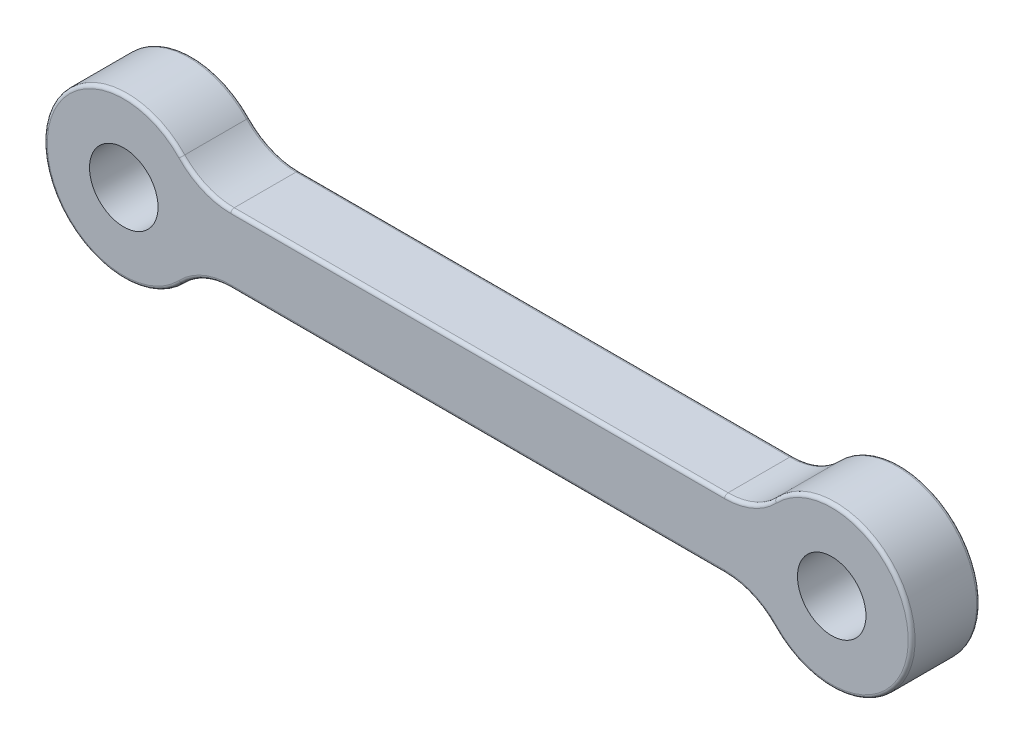
ISO-10303-21;
HEADER;
FILE_DESCRIPTION(('STEP AP214'),'2;1');
FILE_NAME('part.step','',(''),(''),'','','');
FILE_SCHEMA(('AUTOMOTIVE_DESIGN { 1 0 10303 214 1 1 1 1 }'));
ENDSEC;
DATA;
#1=APPLICATION_CONTEXT('core data for automotive mechanical design processes');
#2=APPLICATION_PROTOCOL_DEFINITION('international standard','automotive_design',2000,#1);
#3=PRODUCT_CONTEXT('',#1,'mechanical');
#4=PRODUCT('Part','Part','',(#3));
#5=PRODUCT_RELATED_PRODUCT_CATEGORY('part','',(#4));
#6=PRODUCT_DEFINITION_FORMATION('','',#4);
#7=PRODUCT_DEFINITION_CONTEXT('part definition',#1,'design');
#8=PRODUCT_DEFINITION('design','',#6,#7);
#9=PRODUCT_DEFINITION_SHAPE('','',#8);
#10=(LENGTH_UNIT() NAMED_UNIT(*) SI_UNIT(.MILLI.,.METRE.));
#11=(NAMED_UNIT(*) PLANE_ANGLE_UNIT() SI_UNIT($,.RADIAN.));
#12=(NAMED_UNIT(*) SI_UNIT($,.STERADIAN.) SOLID_ANGLE_UNIT());
#13=UNCERTAINTY_MEASURE_WITH_UNIT(LENGTH_MEASURE(1.E-05),#10,'distance_accuracy_value','');
#14=(GEOMETRIC_REPRESENTATION_CONTEXT(3) GLOBAL_UNCERTAINTY_ASSIGNED_CONTEXT((#13)) GLOBAL_UNIT_ASSIGNED_CONTEXT((#10,
#11,#12)) REPRESENTATION_CONTEXT('',''));
#15=CARTESIAN_POINT('',(0.,0.,0.));
#16=DIRECTION('',(0.,0.,1.));
#17=DIRECTION('',(1.,0.,0.));
#18=AXIS2_PLACEMENT_3D('',#15,#16,#17);
#19=CARTESIAN_POINT('',(13.5714024219947,4.5,1.35));
#20=DIRECTION('',(0.,0.,1.));
#21=DIRECTION('',(1.,0.,0.));
#22=AXIS2_PLACEMENT_3D('',#19,#20,#21);
#23=TOROIDAL_SURFACE('',#22,3.15,0.15);
#24=CARTESIAN_POINT('',(15.8444500594476,2.31923076923077,1.35));
#25=DIRECTION('',(-0.6923076923077,-0.721602424588213,0.));
#26=DIRECTION('',(0.721602424588213,-0.6923076923077,0.));
#27=AXIS2_PLACEMENT_3D('',#24,#25,#26);
#28=CIRCLE('',#27,0.15);
#29=CARTESIAN_POINT('',(15.8444500594476,2.31923076923077,1.5));
#30=VERTEX_POINT('',#29);
#31=CARTESIAN_POINT('',(15.7362096957594,2.42307692307692,1.35));
#32=VERTEX_POINT('',#31);
#33=EDGE_CURVE('E461',#30,#32,#28,.T.);
#34=ORIENTED_EDGE('',*,*,#33,.T.);
#35=CARTESIAN_POINT('',(13.5714024219947,4.5,1.35));
#36=DIRECTION('',(0.,0.,1.));
#37=DIRECTION('',(1.,0.,0.));
#38=AXIS2_PLACEMENT_3D('',#35,#36,#37);
#39=CIRCLE('',#38,3.);
#40=CARTESIAN_POINT('',(13.5714024219947,1.5,1.35));
#41=VERTEX_POINT('',#40);
#42=EDGE_CURVE('E246',#41,#32,#39,.T.);
#43=ORIENTED_EDGE('',*,*,#42,.F.);
#44=CARTESIAN_POINT('',(13.5714024219947,1.35,1.35));
#45=DIRECTION('',(1.,0.,0.));
#46=DIRECTION('',(0.,0.,-1.));
#47=AXIS2_PLACEMENT_3D('',#44,#45,#46);
#48=CIRCLE('',#47,0.15);
#49=CARTESIAN_POINT('',(13.5714024219947,1.35,1.5));
#50=VERTEX_POINT('',#49);
#51=EDGE_CURVE('E11',#41,#50,#48,.T.);
#52=ORIENTED_EDGE('',*,*,#51,.T.);
#53=CARTESIAN_POINT('',(13.5714024219947,4.5,1.5));
#54=DIRECTION('',(0.,0.,-1.));
#55=DIRECTION('',(1.,0.,0.));
#56=AXIS2_PLACEMENT_3D('',#53,#54,#55);
#57=CIRCLE('',#56,3.15);
#58=EDGE_CURVE('E296',#30,#50,#57,.T.);
#59=ORIENTED_EDGE('',*,*,#58,.F.);
#60=EDGE_LOOP('',(#34,#43,#52,#59));
#61=FACE_BOUND('',#60,.T.);
#62=ADVANCED_FACE('F17',(#61),#23,.T.);
#63=CARTESIAN_POINT('',(0.,1.35,1.35));
#64=DIRECTION('',(1.,0.,0.));
#65=DIRECTION('',(0.,0.,-1.));
#66=AXIS2_PLACEMENT_3D('',#63,#64,#65);
#67=CYLINDRICAL_SURFACE('',#66,0.15);
#68=CARTESIAN_POINT('',(-8.0477660583584,1.35,1.35));
#69=DIRECTION('',(1.,0.,0.));
#70=DIRECTION('',(0.,0.,-1.));
#71=AXIS2_PLACEMENT_3D('',#68,#69,#70);
#72=CIRCLE('',#71,0.15);
#73=CARTESIAN_POINT('',(-8.0477660583584,1.5,1.35));
#74=VERTEX_POINT('',#73);
#75=CARTESIAN_POINT('',(-8.0477660583584,1.35,1.5));
#76=VERTEX_POINT('',#75);
#77=EDGE_CURVE('E25',#74,#76,#72,.T.);
#78=ORIENTED_EDGE('',*,*,#77,.T.);
#79=DIRECTION('',(-1.,0.,0.));
#80=VECTOR('',#79,1.);
#81=CARTESIAN_POINT('',(-8.0477660583584,1.35,1.5));
#82=LINE('',#81,#80);
#83=EDGE_CURVE('E288',#50,#76,#82,.T.);
#84=ORIENTED_EDGE('',*,*,#83,.F.);
#85=ORIENTED_EDGE('',*,*,#51,.F.);
#86=DIRECTION('',(1.,0.,0.));
#87=VECTOR('',#86,1.);
#88=CARTESIAN_POINT('',(13.5714024219947,1.5,1.35));
#89=LINE('',#88,#87);
#90=EDGE_CURVE('E263',#74,#41,#89,.T.);
#91=ORIENTED_EDGE('',*,*,#90,.F.);
#92=EDGE_LOOP('',(#78,#84,#85,#91));
#93=FACE_BOUND('',#92,.T.);
#94=ADVANCED_FACE('F376',(#93),#67,.T.);
#95=CARTESIAN_POINT('',(-8.0477660583584,4.5,1.35));
#96=DIRECTION('',(0.,0.,1.));
#97=DIRECTION('',(1.,0.,0.));
#98=AXIS2_PLACEMENT_3D('',#95,#96,#97);
#99=TOROIDAL_SURFACE('',#98,3.15,0.15);
#100=CARTESIAN_POINT('',(-10.3208136958113,2.31923076923077,1.35));
#101=DIRECTION('',(0.692307692307693,-0.72160242458822,0.));
#102=DIRECTION('',(0.72160242458822,0.692307692307693,0.));
#103=AXIS2_PLACEMENT_3D('',#100,#101,#102);
#104=CIRCLE('',#103,0.15);
#105=CARTESIAN_POINT('',(-10.2125733321231,2.42307692307692,1.35));
#106=VERTEX_POINT('',#105);
#107=CARTESIAN_POINT('',(-10.3208136958113,2.31923076923077,1.5));
#108=VERTEX_POINT('',#107);
#109=EDGE_CURVE('E224',#106,#108,#104,.T.);
#110=ORIENTED_EDGE('',*,*,#109,.T.);
#111=CARTESIAN_POINT('',(-8.0477660583584,4.5,1.5));
#112=DIRECTION('',(0.,0.,-1.));
#113=DIRECTION('',(1.,0.,0.));
#114=AXIS2_PLACEMENT_3D('',#111,#112,#113);
#115=CIRCLE('',#114,3.15);
#116=EDGE_CURVE('E283',#76,#108,#115,.T.);
#117=ORIENTED_EDGE('',*,*,#116,.F.);
#118=ORIENTED_EDGE('',*,*,#77,.F.);
#119=CARTESIAN_POINT('',(-8.0477660583584,4.5,1.35));
#120=DIRECTION('',(0.,0.,1.));
#121=DIRECTION('',(1.,0.,0.));
#122=AXIS2_PLACEMENT_3D('',#119,#120,#121);
#123=CIRCLE('',#122,3.);
#124=EDGE_CURVE('E247',#106,#74,#123,.T.);
#125=ORIENTED_EDGE('',*,*,#124,.F.);
#126=EDGE_LOOP('',(#110,#117,#118,#125));
#127=FACE_BOUND('',#126,.T.);
#128=ADVANCED_FACE('F366',(#127),#99,.T.);
#129=CARTESIAN_POINT('',(13.5714024219947,-4.5,1.35));
#130=DIRECTION('',(0.,0.,1.));
#131=DIRECTION('',(1.,0.,0.));
#132=AXIS2_PLACEMENT_3D('',#129,#130,#131);
#133=TOROIDAL_SURFACE('',#132,3.15,0.15);
#134=CARTESIAN_POINT('',(13.5714024219947,-1.35,1.35));
#135=DIRECTION('',(1.,0.,0.));
#136=DIRECTION('',(0.,0.,-1.));
#137=AXIS2_PLACEMENT_3D('',#134,#135,#136);
#138=CIRCLE('',#137,0.15);
#139=CARTESIAN_POINT('',(13.5714024219947,-1.35,1.5));
#140=VERTEX_POINT('',#139);
#141=CARTESIAN_POINT('',(13.5714024219947,-1.5,1.35));
#142=VERTEX_POINT('',#141);
#143=EDGE_CURVE('E257',#140,#142,#138,.T.);
#144=ORIENTED_EDGE('',*,*,#143,.T.);
#145=CARTESIAN_POINT('',(13.5714024219947,-4.5,1.35));
#146=DIRECTION('',(0.,0.,1.));
#147=DIRECTION('',(1.,0.,0.));
#148=AXIS2_PLACEMENT_3D('',#145,#146,#147);
#149=CIRCLE('',#148,3.);
#150=CARTESIAN_POINT('',(15.7362096957594,-2.42307692307692,1.35));
#151=VERTEX_POINT('',#150);
#152=EDGE_CURVE('E315',#151,#142,#149,.T.);
#153=ORIENTED_EDGE('',*,*,#152,.F.);
#154=CARTESIAN_POINT('',(15.8444500594476,-2.31923076923077,1.35));
#155=DIRECTION('',(0.6923076923077,-0.721602424588213,0.));
#156=DIRECTION('',(0.721602424588213,0.6923076923077,0.));
#157=AXIS2_PLACEMENT_3D('',#154,#155,#156);
#158=CIRCLE('',#157,0.15);
#159=CARTESIAN_POINT('',(15.8444500594476,-2.31923076923077,1.5));
#160=VERTEX_POINT('',#159);
#161=EDGE_CURVE('E440',#160,#151,#158,.T.);
#162=ORIENTED_EDGE('',*,*,#161,.F.);
#163=CARTESIAN_POINT('',(13.5714024219947,-4.5,1.5));
#164=DIRECTION('',(0.,0.,-1.));
#165=DIRECTION('',(1.,0.,0.));
#166=AXIS2_PLACEMENT_3D('',#163,#164,#165);
#167=CIRCLE('',#166,3.15);
#168=EDGE_CURVE('E311',#140,#160,#167,.T.);
#169=ORIENTED_EDGE('',*,*,#168,.F.);
#170=EDGE_LOOP('',(#144,#153,#162,#169));
#171=FACE_BOUND('',#170,.T.);
#172=ADVANCED_FACE('F483',(#171),#133,.T.);
#173=CARTESIAN_POINT('',(-12.7381818181818,0.,1.35));
#174=DIRECTION('',(0.,0.,1.));
#175=DIRECTION('',(-1.,0.,0.));
#176=AXIS2_PLACEMENT_3D('',#173,#174,#175);
#177=TOROIDAL_SURFACE('',#176,3.35,0.15);
#178=CARTESIAN_POINT('',(-10.3208136958113,-2.31923076923077,1.35));
#179=DIRECTION('',(-0.692307692307693,-0.72160242458822,0.));
#180=DIRECTION('',(0.72160242458822,-0.692307692307693,0.));
#181=AXIS2_PLACEMENT_3D('',#178,#179,#180);
#182=CIRCLE('',#181,0.15);
#183=CARTESIAN_POINT('',(-10.2125733321231,-2.42307692307692,1.35));
#184=VERTEX_POINT('',#183);
#185=CARTESIAN_POINT('',(-10.3208136958113,-2.31923076923077,1.5));
#186=VERTEX_POINT('',#185);
#187=EDGE_CURVE('E184',#184,#186,#182,.T.);
#188=ORIENTED_EDGE('',*,*,#187,.T.);
#189=CARTESIAN_POINT('',(-12.7381818181818,0.,1.5));
#190=DIRECTION('',(0.,0.,1.));
#191=DIRECTION('',(1.,0.,0.));
#192=AXIS2_PLACEMENT_3D('',#189,#190,#191);
#193=CIRCLE('',#192,3.35);
#194=EDGE_CURVE('E287',#108,#186,#193,.T.);
#195=ORIENTED_EDGE('',*,*,#194,.F.);
#196=ORIENTED_EDGE('',*,*,#109,.F.);
#197=CARTESIAN_POINT('',(-12.7381818181818,0.,1.35));
#198=DIRECTION('',(0.,0.,-1.));
#199=DIRECTION('',(1.,0.,0.));
#200=AXIS2_PLACEMENT_3D('',#197,#198,#199);
#201=CIRCLE('',#200,3.5);
#202=EDGE_CURVE('E217',#184,#106,#201,.T.);
#203=ORIENTED_EDGE('',*,*,#202,.F.);
#204=EDGE_LOOP('',(#188,#195,#196,#203));
#205=FACE_BOUND('',#204,.T.);
#206=ADVANCED_FACE('F223',(#205),#177,.T.);
#207=CARTESIAN_POINT('',(0.,-1.35,1.35));
#208=DIRECTION('',(-1.,0.,0.));
#209=DIRECTION('',(0.,0.,1.));
#210=AXIS2_PLACEMENT_3D('',#207,#208,#209);
#211=CYLINDRICAL_SURFACE('',#210,0.15);
#212=CARTESIAN_POINT('',(-8.0477660583584,-1.35,1.35));
#213=DIRECTION('',(1.,0.,0.));
#214=DIRECTION('',(0.,0.,-1.));
#215=AXIS2_PLACEMENT_3D('',#212,#213,#214);
#216=CIRCLE('',#215,0.15);
#217=CARTESIAN_POINT('',(-8.0477660583584,-1.35,1.5));
#218=VERTEX_POINT('',#217);
#219=CARTESIAN_POINT('',(-8.0477660583584,-1.5,1.35));
#220=VERTEX_POINT('',#219);
#221=EDGE_CURVE('E196',#218,#220,#216,.T.);
#222=ORIENTED_EDGE('',*,*,#221,.T.);
#223=DIRECTION('',(-1.,0.,0.));
#224=VECTOR('',#223,1.);
#225=CARTESIAN_POINT('',(0.,-1.5,1.35));
#226=LINE('',#225,#224);
#227=EDGE_CURVE('E273',#142,#220,#226,.T.);
#228=ORIENTED_EDGE('',*,*,#227,.F.);
#229=ORIENTED_EDGE('',*,*,#143,.F.);
#230=DIRECTION('',(1.,0.,0.));
#231=VECTOR('',#230,1.);
#232=CARTESIAN_POINT('',(0.,-1.35,1.5));
#233=LINE('',#232,#231);
#234=EDGE_CURVE('E307',#218,#140,#233,.T.);
#235=ORIENTED_EDGE('',*,*,#234,.F.);
#236=EDGE_LOOP('',(#222,#228,#229,#235));
#237=FACE_BOUND('',#236,.T.);
#238=ADVANCED_FACE('F517',(#237),#211,.T.);
#239=CARTESIAN_POINT('',(-8.0477660583584,-4.5,1.35));
#240=DIRECTION('',(0.,0.,1.));
#241=DIRECTION('',(1.,0.,0.));
#242=AXIS2_PLACEMENT_3D('',#239,#240,#241);
#243=TOROIDAL_SURFACE('',#242,3.15,0.15);
#244=ORIENTED_EDGE('',*,*,#187,.F.);
#245=CARTESIAN_POINT('',(-8.0477660583584,-4.5,1.35));
#246=DIRECTION('',(0.,0.,1.));
#247=DIRECTION('',(1.,0.,0.));
#248=AXIS2_PLACEMENT_3D('',#245,#246,#247);
#249=CIRCLE('',#248,3.);
#250=EDGE_CURVE('E187',#220,#184,#249,.T.);
#251=ORIENTED_EDGE('',*,*,#250,.F.);
#252=ORIENTED_EDGE('',*,*,#221,.F.);
#253=CARTESIAN_POINT('',(-8.0477660583584,-4.5,1.5));
#254=DIRECTION('',(0.,0.,-1.));
#255=DIRECTION('',(1.,0.,0.));
#256=AXIS2_PLACEMENT_3D('',#253,#254,#255);
#257=CIRCLE('',#256,3.15);
#258=EDGE_CURVE('E190',#186,#218,#257,.T.);
#259=ORIENTED_EDGE('',*,*,#258,.F.);
#260=EDGE_LOOP('',(#244,#251,#252,#259));
#261=FACE_BOUND('',#260,.T.);
#262=ADVANCED_FACE('F186',(#261),#243,.T.);
#263=CARTESIAN_POINT('',(13.5714024219947,-4.5,-1.35));
#264=DIRECTION('',(0.,0.,1.));
#265=DIRECTION('',(1.,0.,0.));
#266=AXIS2_PLACEMENT_3D('',#263,#264,#265);
#267=TOROIDAL_SURFACE('',#266,3.15,0.15);
#268=CARTESIAN_POINT('',(15.8444500594476,-2.31923076923077,-1.35));
#269=DIRECTION('',(-0.6923076923077,0.721602424588213,0.));
#270=DIRECTION('',(-0.721602424588213,-0.6923076923077,0.));
#271=AXIS2_PLACEMENT_3D('',#268,#269,#270);
#272=CIRCLE('',#271,0.15);
#273=CARTESIAN_POINT('',(15.8444500594476,-2.31923076923077,-1.5));
#274=VERTEX_POINT('',#273);
#275=CARTESIAN_POINT('',(15.7362096957594,-2.42307692307692,-1.35));
#276=VERTEX_POINT('',#275);
#277=EDGE_CURVE('E403',#274,#276,#272,.T.);
#278=ORIENTED_EDGE('',*,*,#277,.T.);
#279=CARTESIAN_POINT('',(13.5714024219947,-4.5,-1.35));
#280=DIRECTION('',(0.,0.,-1.));
#281=DIRECTION('',(1.,0.,0.));
#282=AXIS2_PLACEMENT_3D('',#279,#280,#281);
#283=CIRCLE('',#282,3.);
#284=CARTESIAN_POINT('',(13.5714024219947,-1.5,-1.35));
#285=VERTEX_POINT('',#284);
#286=EDGE_CURVE('E210',#285,#276,#283,.T.);
#287=ORIENTED_EDGE('',*,*,#286,.F.);
#288=CARTESIAN_POINT('',(13.5714024219947,-1.35,-1.35));
#289=DIRECTION('',(1.,0.,0.));
#290=DIRECTION('',(0.,0.,-1.));
#291=AXIS2_PLACEMENT_3D('',#288,#289,#290);
#292=CIRCLE('',#291,0.15);
#293=CARTESIAN_POINT('',(13.5714024219947,-1.35,-1.5));
#294=VERTEX_POINT('',#293);
#295=EDGE_CURVE('E197',#285,#294,#292,.T.);
#296=ORIENTED_EDGE('',*,*,#295,.T.);
#297=CARTESIAN_POINT('',(13.5714024219947,-4.5,-1.5));
#298=DIRECTION('',(0.,0.,1.));
#299=DIRECTION('',(1.,0.,0.));
#300=AXIS2_PLACEMENT_3D('',#297,#298,#299);
#301=CIRCLE('',#300,3.15);
#302=EDGE_CURVE('E314',#274,#294,#301,.T.);
#303=ORIENTED_EDGE('',*,*,#302,.F.);
#304=EDGE_LOOP('',(#278,#287,#296,#303));
#305=FACE_BOUND('',#304,.T.);
#306=ADVANCED_FACE('F490',(#305),#267,.T.);
#307=CARTESIAN_POINT('',(0.,-1.35,-1.35));
#308=DIRECTION('',(1.,0.,0.));
#309=DIRECTION('',(0.,0.,-1.));
#310=AXIS2_PLACEMENT_3D('',#307,#308,#309);
#311=CYLINDRICAL_SURFACE('',#310,0.15);
#312=CARTESIAN_POINT('',(-8.0477660583584,-1.35,-1.35));
#313=DIRECTION('',(1.,0.,0.));
#314=DIRECTION('',(0.,0.,-1.));
#315=AXIS2_PLACEMENT_3D('',#312,#313,#314);
#316=CIRCLE('',#315,0.15);
#317=CARTESIAN_POINT('',(-8.0477660583584,-1.5,-1.35));
#318=VERTEX_POINT('',#317);
#319=CARTESIAN_POINT('',(-8.0477660583584,-1.35,-1.5));
#320=VERTEX_POINT('',#319);
#321=EDGE_CURVE('E356',#318,#320,#316,.T.);
#322=ORIENTED_EDGE('',*,*,#321,.T.);
#323=DIRECTION('',(-1.,0.,0.));
#324=VECTOR('',#323,1.);
#325=CARTESIAN_POINT('',(-8.0477660583584,-1.35,-1.5));
#326=LINE('',#325,#324);
#327=EDGE_CURVE('E324',#294,#320,#326,.T.);
#328=ORIENTED_EDGE('',*,*,#327,.F.);
#329=ORIENTED_EDGE('',*,*,#295,.F.);
#330=DIRECTION('',(1.,0.,0.));
#331=VECTOR('',#330,1.);
#332=CARTESIAN_POINT('',(13.5714024219947,-1.5,-1.35));
#333=LINE('',#332,#331);
#334=EDGE_CURVE('E278',#318,#285,#333,.T.);
#335=ORIENTED_EDGE('',*,*,#334,.F.);
#336=EDGE_LOOP('',(#322,#328,#329,#335));
#337=FACE_BOUND('',#336,.T.);
#338=ADVANCED_FACE('F496',(#337),#311,.T.);
#339=CARTESIAN_POINT('',(-8.0477660583584,-4.5,-1.35));
#340=DIRECTION('',(0.,0.,1.));
#341=DIRECTION('',(1.,0.,0.));
#342=AXIS2_PLACEMENT_3D('',#339,#340,#341);
#343=TOROIDAL_SURFACE('',#342,3.15,0.15);
#344=CARTESIAN_POINT('',(-10.3208136958113,-2.31923076923077,-1.35));
#345=DIRECTION('',(0.692307692307693,0.72160242458822,0.));
#346=DIRECTION('',(-0.72160242458822,0.692307692307693,0.));
#347=AXIS2_PLACEMENT_3D('',#344,#345,#346);
#348=CIRCLE('',#347,0.15);
#349=CARTESIAN_POINT('',(-10.2125733321231,-2.42307692307692,-1.35));
#350=VERTEX_POINT('',#349);
#351=CARTESIAN_POINT('',(-10.3208136958113,-2.31923076923077,-1.5));
#352=VERTEX_POINT('',#351);
#353=EDGE_CURVE('E347',#350,#352,#348,.T.);
#354=ORIENTED_EDGE('',*,*,#353,.T.);
#355=CARTESIAN_POINT('',(-8.0477660583584,-4.5,-1.5));
#356=DIRECTION('',(0.,0.,1.));
#357=DIRECTION('',(1.,0.,0.));
#358=AXIS2_PLACEMENT_3D('',#355,#356,#357);
#359=CIRCLE('',#358,3.15);
#360=EDGE_CURVE('E328',#320,#352,#359,.T.);
#361=ORIENTED_EDGE('',*,*,#360,.F.);
#362=ORIENTED_EDGE('',*,*,#321,.F.);
#363=CARTESIAN_POINT('',(-8.0477660583584,-4.5,-1.35));
#364=DIRECTION('',(0.,0.,-1.));
#365=DIRECTION('',(1.,0.,0.));
#366=AXIS2_PLACEMENT_3D('',#363,#364,#365);
#367=CIRCLE('',#366,3.);
#368=EDGE_CURVE('E211',#350,#318,#367,.T.);
#369=ORIENTED_EDGE('',*,*,#368,.F.);
#370=EDGE_LOOP('',(#354,#361,#362,#369));
#371=FACE_BOUND('',#370,.T.);
#372=ADVANCED_FACE('F390',(#371),#343,.T.);
#373=CARTESIAN_POINT('',(13.5714024219947,4.5,-1.35));
#374=DIRECTION('',(0.,0.,1.));
#375=DIRECTION('',(1.,0.,0.));
#376=AXIS2_PLACEMENT_3D('',#373,#374,#375);
#377=TOROIDAL_SURFACE('',#376,3.15,0.15);
#378=CARTESIAN_POINT('',(13.5714024219947,1.35,-1.35));
#379=DIRECTION('',(1.,0.,0.));
#380=DIRECTION('',(0.,0.,-1.));
#381=AXIS2_PLACEMENT_3D('',#378,#379,#380);
#382=CIRCLE('',#381,0.15);
#383=CARTESIAN_POINT('',(13.5714024219947,1.35,-1.5));
#384=VERTEX_POINT('',#383);
#385=CARTESIAN_POINT('',(13.5714024219947,1.5,-1.35));
#386=VERTEX_POINT('',#385);
#387=EDGE_CURVE('E37',#384,#386,#382,.T.);
#388=ORIENTED_EDGE('',*,*,#387,.T.);
#389=CARTESIAN_POINT('',(13.5714024219947,4.5,-1.35));
#390=DIRECTION('',(0.,0.,-1.));
#391=DIRECTION('',(1.,0.,0.));
#392=AXIS2_PLACEMENT_3D('',#389,#390,#391);
#393=CIRCLE('',#392,3.);
#394=CARTESIAN_POINT('',(15.7362096957594,2.42307692307692,-1.35));
#395=VERTEX_POINT('',#394);
#396=EDGE_CURVE('E243',#395,#386,#393,.T.);
#397=ORIENTED_EDGE('',*,*,#396,.F.);
#398=CARTESIAN_POINT('',(15.8444500594476,2.31923076923077,-1.35));
#399=DIRECTION('',(0.6923076923077,0.721602424588213,0.));
#400=DIRECTION('',(-0.721602424588213,0.6923076923077,0.));
#401=AXIS2_PLACEMENT_3D('',#398,#399,#400);
#402=CIRCLE('',#401,0.15);
#403=CARTESIAN_POINT('',(15.8444500594476,2.31923076923077,-1.5));
#404=VERTEX_POINT('',#403);
#405=EDGE_CURVE('E404',#404,#395,#402,.T.);
#406=ORIENTED_EDGE('',*,*,#405,.F.);
#407=CARTESIAN_POINT('',(13.5714024219947,4.5,-1.5));
#408=DIRECTION('',(0.,0.,1.));
#409=DIRECTION('',(1.,0.,0.));
#410=AXIS2_PLACEMENT_3D('',#407,#408,#409);
#411=CIRCLE('',#410,3.15);
#412=EDGE_CURVE('E300',#384,#404,#411,.T.);
#413=ORIENTED_EDGE('',*,*,#412,.F.);
#414=EDGE_LOOP('',(#388,#397,#406,#413));
#415=FACE_BOUND('',#414,.T.);
#416=ADVANCED_FACE('F564',(#415),#377,.T.);
#417=CARTESIAN_POINT('',(-12.7381818181818,0.,-1.35));
#418=DIRECTION('',(0.,0.,1.));
#419=DIRECTION('',(-1.,0.,0.));
#420=AXIS2_PLACEMENT_3D('',#417,#418,#419);
#421=TOROIDAL_SURFACE('',#420,3.35,0.15);
#422=CARTESIAN_POINT('',(-10.3208136958113,2.31923076923077,-1.35));
#423=DIRECTION('',(-0.692307692307693,0.72160242458822,0.));
#424=DIRECTION('',(-0.72160242458822,-0.692307692307693,0.));
#425=AXIS2_PLACEMENT_3D('',#422,#423,#424);
#426=CIRCLE('',#425,0.15);
#427=CARTESIAN_POINT('',(-10.2125733321231,2.42307692307692,-1.35));
#428=VERTEX_POINT('',#427);
#429=CARTESIAN_POINT('',(-10.3208136958113,2.31923076923077,-1.5));
#430=VERTEX_POINT('',#429);
#431=EDGE_CURVE('E319',#428,#430,#426,.T.);
#432=ORIENTED_EDGE('',*,*,#431,.T.);
#433=CARTESIAN_POINT('',(-12.7381818181818,0.,-1.5));
#434=DIRECTION('',(0.,0.,-1.));
#435=DIRECTION('',(1.,0.,0.));
#436=AXIS2_PLACEMENT_3D('',#433,#434,#435);
#437=CIRCLE('',#436,3.35);
#438=EDGE_CURVE('E332',#352,#430,#437,.T.);
#439=ORIENTED_EDGE('',*,*,#438,.F.);
#440=ORIENTED_EDGE('',*,*,#353,.F.);
#441=CARTESIAN_POINT('',(-12.7381818181818,0.,-1.35));
#442=DIRECTION('',(0.,0.,1.));
#443=DIRECTION('',(1.,0.,0.));
#444=AXIS2_PLACEMENT_3D('',#441,#442,#443);
#445=CIRCLE('',#444,3.5);
#446=EDGE_CURVE('E219',#428,#350,#445,.T.);
#447=ORIENTED_EDGE('',*,*,#446,.F.);
#448=EDGE_LOOP('',(#432,#439,#440,#447));
#449=FACE_BOUND('',#448,.T.);
#450=ADVANCED_FACE('F383',(#449),#421,.T.);
#451=CARTESIAN_POINT('',(0.,1.35,-1.35));
#452=DIRECTION('',(-1.,0.,0.));
#453=DIRECTION('',(0.,0.,1.));
#454=AXIS2_PLACEMENT_3D('',#451,#452,#453);
#455=CYLINDRICAL_SURFACE('',#454,0.15);
#456=CARTESIAN_POINT('',(-8.0477660583584,1.35,-1.35));
#457=DIRECTION('',(1.,0.,0.));
#458=DIRECTION('',(0.,0.,-1.));
#459=AXIS2_PLACEMENT_3D('',#456,#457,#458);
#460=CIRCLE('',#459,0.15);
#461=CARTESIAN_POINT('',(-8.0477660583584,1.35,-1.5));
#462=VERTEX_POINT('',#461);
#463=CARTESIAN_POINT('',(-8.0477660583584,1.5,-1.35));
#464=VERTEX_POINT('',#463);
#465=EDGE_CURVE('E47',#462,#464,#460,.T.);
#466=ORIENTED_EDGE('',*,*,#465,.T.);
#467=DIRECTION('',(-1.,0.,0.));
#468=VECTOR('',#467,1.);
#469=CARTESIAN_POINT('',(0.,1.5,-1.35));
#470=LINE('',#469,#468);
#471=EDGE_CURVE('E252',#386,#464,#470,.T.);
#472=ORIENTED_EDGE('',*,*,#471,.F.);
#473=ORIENTED_EDGE('',*,*,#387,.F.);
#474=DIRECTION('',(1.,0.,0.));
#475=VECTOR('',#474,1.);
#476=CARTESIAN_POINT('',(0.,1.35,-1.5));
#477=LINE('',#476,#475);
#478=EDGE_CURVE('E304',#462,#384,#477,.T.);
#479=ORIENTED_EDGE('',*,*,#478,.F.);
#480=EDGE_LOOP('',(#466,#472,#473,#479));
#481=FACE_BOUND('',#480,.T.);
#482=ADVANCED_FACE('F499',(#481),#455,.T.);
#483=CARTESIAN_POINT('',(-8.0477660583584,4.5,-1.35));
#484=DIRECTION('',(0.,0.,1.));
#485=DIRECTION('',(1.,0.,0.));
#486=AXIS2_PLACEMENT_3D('',#483,#484,#485);
#487=TOROIDAL_SURFACE('',#486,3.15,0.15);
#488=ORIENTED_EDGE('',*,*,#431,.F.);
#489=CARTESIAN_POINT('',(-8.0477660583584,4.5,-1.35));
#490=DIRECTION('',(0.,0.,-1.));
#491=DIRECTION('',(1.,0.,0.));
#492=AXIS2_PLACEMENT_3D('',#489,#490,#491);
#493=CIRCLE('',#492,3.);
#494=EDGE_CURVE('E303',#464,#428,#493,.T.);
#495=ORIENTED_EDGE('',*,*,#494,.F.);
#496=ORIENTED_EDGE('',*,*,#465,.F.);
#497=CARTESIAN_POINT('',(-8.0477660583584,4.5,-1.5));
#498=DIRECTION('',(0.,0.,1.));
#499=DIRECTION('',(1.,0.,0.));
#500=AXIS2_PLACEMENT_3D('',#497,#498,#499);
#501=CIRCLE('',#500,3.15);
#502=EDGE_CURVE('E323',#430,#462,#501,.T.);
#503=ORIENTED_EDGE('',*,*,#502,.F.);
#504=EDGE_LOOP('',(#488,#495,#496,#503));
#505=FACE_BOUND('',#504,.T.);
#506=ADVANCED_FACE('F497',(#505),#487,.T.);
#507=CARTESIAN_POINT('',(13.5714024219947,-4.5,1.5));
#508=DIRECTION('',(0.,0.,-1.));
#509=DIRECTION('',(-1.,0.,0.));
#510=AXIS2_PLACEMENT_3D('',#507,#508,#509);
#511=CYLINDRICAL_SURFACE('',#510,3.);
#512=DIRECTION('',(0.,0.,1.));
#513=VECTOR('',#512,1.);
#514=CARTESIAN_POINT('',(13.5714024219947,-1.5,1.5));
#515=LINE('',#514,#513);
#516=EDGE_CURVE('E267',#285,#142,#515,.T.);
#517=ORIENTED_EDGE('',*,*,#516,.F.);
#518=ORIENTED_EDGE('',*,*,#286,.T.);
#519=DIRECTION('',(0.,0.,-1.));
#520=VECTOR('',#519,1.);
#521=CARTESIAN_POINT('',(15.7362096957594,-2.42307692307692,1.5));
#522=LINE('',#521,#520);
#523=EDGE_CURVE('E282',#151,#276,#522,.T.);
#524=ORIENTED_EDGE('',*,*,#523,.F.);
#525=ORIENTED_EDGE('',*,*,#152,.T.);
#526=EDGE_LOOP('',(#517,#518,#524,#525));
#527=FACE_BOUND('',#526,.T.);
#528=ADVANCED_FACE('F487',(#527),#511,.F.);
#529=CARTESIAN_POINT('',(-8.0477660583584,-4.5,1.5));
#530=DIRECTION('',(0.,0.,-1.));
#531=DIRECTION('',(-1.,0.,0.));
#532=AXIS2_PLACEMENT_3D('',#529,#530,#531);
#533=CYLINDRICAL_SURFACE('',#532,3.);
#534=DIRECTION('',(0.,0.,1.));
#535=VECTOR('',#534,1.);
#536=CARTESIAN_POINT('',(-10.2125733321231,-2.42307692307692,1.5));
#537=LINE('',#536,#535);
#538=EDGE_CURVE('E204',#350,#184,#537,.T.);
#539=ORIENTED_EDGE('',*,*,#538,.F.);
#540=ORIENTED_EDGE('',*,*,#368,.T.);
#541=DIRECTION('',(0.,0.,-1.));
#542=VECTOR('',#541,1.);
#543=CARTESIAN_POINT('',(-8.0477660583584,-1.5,1.5));
#544=LINE('',#543,#542);
#545=EDGE_CURVE('E207',#220,#318,#544,.T.);
#546=ORIENTED_EDGE('',*,*,#545,.F.);
#547=ORIENTED_EDGE('',*,*,#250,.T.);
#548=EDGE_LOOP('',(#539,#540,#546,#547));
#549=FACE_BOUND('',#548,.T.);
#550=ADVANCED_FACE('F202',(#549),#533,.F.);
#551=CARTESIAN_POINT('',(13.5714024219947,4.5,1.5));
#552=DIRECTION('',(0.,0.,-1.));
#553=DIRECTION('',(-1.,0.,0.));
#554=AXIS2_PLACEMENT_3D('',#551,#552,#553);
#555=CYLINDRICAL_SURFACE('',#554,3.);
#556=DIRECTION('',(0.,0.,1.));
#557=VECTOR('',#556,1.);
#558=CARTESIAN_POINT('',(15.7362096957594,2.42307692307692,1.5));
#559=LINE('',#558,#557);
#560=EDGE_CURVE('E292',#395,#32,#559,.T.);
#561=ORIENTED_EDGE('',*,*,#560,.F.);
#562=ORIENTED_EDGE('',*,*,#396,.T.);
#563=DIRECTION('',(0.,0.,-1.));
#564=VECTOR('',#563,1.);
#565=CARTESIAN_POINT('',(13.5714024219947,1.5,-1.5));
#566=LINE('',#565,#564);
#567=EDGE_CURVE('E221',#41,#386,#566,.T.);
#568=ORIENTED_EDGE('',*,*,#567,.F.);
#569=ORIENTED_EDGE('',*,*,#42,.T.);
#570=EDGE_LOOP('',(#561,#562,#568,#569));
#571=FACE_BOUND('',#570,.T.);
#572=ADVANCED_FACE('F536',(#571),#555,.F.);
#573=CARTESIAN_POINT('',(-8.0477660583584,4.5,1.5));
#574=DIRECTION('',(0.,0.,-1.));
#575=DIRECTION('',(-1.,0.,0.));
#576=AXIS2_PLACEMENT_3D('',#573,#574,#575);
#577=CYLINDRICAL_SURFACE('',#576,3.);
#578=DIRECTION('',(0.,0.,1.));
#579=VECTOR('',#578,1.);
#580=CARTESIAN_POINT('',(-8.0477660583584,1.5,1.5));
#581=LINE('',#580,#579);
#582=EDGE_CURVE('E256',#464,#74,#581,.T.);
#583=ORIENTED_EDGE('',*,*,#582,.F.);
#584=ORIENTED_EDGE('',*,*,#494,.T.);
#585=DIRECTION('',(0.,0.,-1.));
#586=VECTOR('',#585,1.);
#587=CARTESIAN_POINT('',(-10.2125733321231,2.42307692307692,1.5));
#588=LINE('',#587,#586);
#589=EDGE_CURVE('E227',#106,#428,#588,.T.);
#590=ORIENTED_EDGE('',*,*,#589,.F.);
#591=ORIENTED_EDGE('',*,*,#124,.T.);
#592=EDGE_LOOP('',(#583,#584,#590,#591));
#593=FACE_BOUND('',#592,.T.);
#594=ADVANCED_FACE('F381',(#593),#577,.F.);
#595=CARTESIAN_POINT('',(0.,0.,-1.5));
#596=DIRECTION('',(0.,0.,1.));
#597=DIRECTION('',(1.,0.,0.));
#598=AXIS2_PLACEMENT_3D('',#595,#596,#597);
#599=PLANE('',#598);
#600=CARTESIAN_POINT('',(18.2618181818182,0.,-1.5));
#601=DIRECTION('',(0.,0.,1.));
#602=DIRECTION('',(1.,0.,0.));
#603=AXIS2_PLACEMENT_3D('',#600,#601,#602);
#604=CIRCLE('',#603,1.5);
#605=CARTESIAN_POINT('',(19.7618181818182,0.,-1.5));
#606=VERTEX_POINT('',#605);
#607=EDGE_CURVE('E412',#606,#606,#604,.T.);
#608=ORIENTED_EDGE('',*,*,#607,.T.);
#609=EDGE_LOOP('',(#608));
#610=FACE_BOUND('',#609,.T.);
#611=CARTESIAN_POINT('',(-12.7381818181818,0.,-1.5));
#612=DIRECTION('',(0.,0.,1.));
#613=DIRECTION('',(1.,0.,0.));
#614=AXIS2_PLACEMENT_3D('',#611,#612,#613);
#615=CIRCLE('',#614,1.5);
#616=CARTESIAN_POINT('',(-11.2381818181818,0.,-1.5));
#617=VERTEX_POINT('',#616);
#618=EDGE_CURVE('E228',#617,#617,#615,.T.);
#619=ORIENTED_EDGE('',*,*,#618,.T.);
#620=EDGE_LOOP('',(#619));
#621=FACE_BOUND('',#620,.T.);
#622=CARTESIAN_POINT('',(18.2618181818182,0.,-1.5));
#623=DIRECTION('',(0.,0.,-1.));
#624=DIRECTION('',(1.,0.,0.));
#625=AXIS2_PLACEMENT_3D('',#622,#623,#624);
#626=CIRCLE('',#625,3.35);
#627=EDGE_CURVE('E434',#404,#274,#626,.T.);
#628=ORIENTED_EDGE('',*,*,#627,.T.);
#629=ORIENTED_EDGE('',*,*,#302,.T.);
#630=ORIENTED_EDGE('',*,*,#327,.T.);
#631=ORIENTED_EDGE('',*,*,#360,.T.);
#632=ORIENTED_EDGE('',*,*,#438,.T.);
#633=ORIENTED_EDGE('',*,*,#502,.T.);
#634=ORIENTED_EDGE('',*,*,#478,.T.);
#635=ORIENTED_EDGE('',*,*,#412,.T.);
#636=EDGE_LOOP('',(#628,#629,#630,#631,#632,#633,#634,#635));
#637=FACE_BOUND('',#636,.T.);
#638=ADVANCED_FACE('F427',(#610,#621,#637),#599,.F.);
#639=CARTESIAN_POINT('',(0.,0.,1.5));
#640=DIRECTION('',(0.,0.,1.));
#641=DIRECTION('',(1.,0.,0.));
#642=AXIS2_PLACEMENT_3D('',#639,#640,#641);
#643=PLANE('',#642);
#644=CARTESIAN_POINT('',(18.2618181818182,0.,1.5));
#645=DIRECTION('',(0.,0.,1.));
#646=DIRECTION('',(1.,0.,0.));
#647=AXIS2_PLACEMENT_3D('',#644,#645,#646);
#648=CIRCLE('',#647,1.5);
#649=CARTESIAN_POINT('',(19.7618181818182,0.,1.5));
#650=VERTEX_POINT('',#649);
#651=EDGE_CURVE('E408',#650,#650,#648,.T.);
#652=ORIENTED_EDGE('',*,*,#651,.F.);
#653=EDGE_LOOP('',(#652));
#654=FACE_BOUND('',#653,.T.);
#655=CARTESIAN_POINT('',(-12.7381818181818,0.,1.5));
#656=DIRECTION('',(0.,0.,1.));
#657=DIRECTION('',(1.,0.,0.));
#658=AXIS2_PLACEMENT_3D('',#655,#656,#657);
#659=CIRCLE('',#658,1.5);
#660=CARTESIAN_POINT('',(-11.2381818181818,0.,1.5));
#661=VERTEX_POINT('',#660);
#662=EDGE_CURVE('E240',#661,#661,#659,.T.);
#663=ORIENTED_EDGE('',*,*,#662,.F.);
#664=EDGE_LOOP('',(#663));
#665=FACE_BOUND('',#664,.T.);
#666=CARTESIAN_POINT('',(18.2618181818182,0.,1.5));
#667=DIRECTION('',(0.,0.,1.));
#668=DIRECTION('',(1.,0.,0.));
#669=AXIS2_PLACEMENT_3D('',#666,#667,#668);
#670=CIRCLE('',#669,3.35);
#671=EDGE_CURVE('E447',#160,#30,#670,.T.);
#672=ORIENTED_EDGE('',*,*,#671,.T.);
#673=ORIENTED_EDGE('',*,*,#58,.T.);
#674=ORIENTED_EDGE('',*,*,#83,.T.);
#675=ORIENTED_EDGE('',*,*,#116,.T.);
#676=ORIENTED_EDGE('',*,*,#194,.T.);
#677=ORIENTED_EDGE('',*,*,#258,.T.);
#678=ORIENTED_EDGE('',*,*,#234,.T.);
#679=ORIENTED_EDGE('',*,*,#168,.T.);
#680=EDGE_LOOP('',(#672,#673,#674,#675,#676,#677,#678,#679));
#681=FACE_BOUND('',#680,.T.);
#682=ADVANCED_FACE('F372',(#654,#665,#681),#643,.T.);
#683=CARTESIAN_POINT('',(18.2618181818182,0.,1.5));
#684=DIRECTION('',(0.,0.,-1.));
#685=DIRECTION('',(1.,0.,0.));
#686=AXIS2_PLACEMENT_3D('',#683,#684,#685);
#687=CYLINDRICAL_SURFACE('',#686,3.5);
#688=ORIENTED_EDGE('',*,*,#523,.T.);
#689=CARTESIAN_POINT('',(18.2618181818182,0.,-1.35));
#690=DIRECTION('',(0.,0.,1.));
#691=DIRECTION('',(1.,0.,0.));
#692=AXIS2_PLACEMENT_3D('',#689,#690,#691);
#693=CIRCLE('',#692,3.5);
#694=EDGE_CURVE('E400',#276,#395,#693,.T.);
#695=ORIENTED_EDGE('',*,*,#694,.T.);
#696=ORIENTED_EDGE('',*,*,#560,.T.);
#697=CARTESIAN_POINT('',(18.2618181818182,0.,1.35));
#698=DIRECTION('',(0.,0.,-1.));
#699=DIRECTION('',(1.,0.,0.));
#700=AXIS2_PLACEMENT_3D('',#697,#698,#699);
#701=CIRCLE('',#700,3.5);
#702=EDGE_CURVE('E465',#32,#151,#701,.T.);
#703=ORIENTED_EDGE('',*,*,#702,.T.);
#704=EDGE_LOOP('',(#688,#695,#696,#703));
#705=FACE_BOUND('',#704,.T.);
#706=ADVANCED_FACE('F473',(#705),#687,.T.);
#707=CARTESIAN_POINT('',(0.,-1.5,1.5));
#708=DIRECTION('',(0.,-1.,0.));
#709=DIRECTION('',(0.,0.,-1.));
#710=AXIS2_PLACEMENT_3D('',#707,#708,#709);
#711=PLANE('',#710);
#712=ORIENTED_EDGE('',*,*,#516,.T.);
#713=ORIENTED_EDGE('',*,*,#227,.T.);
#714=ORIENTED_EDGE('',*,*,#545,.T.);
#715=ORIENTED_EDGE('',*,*,#334,.T.);
#716=EDGE_LOOP('',(#712,#713,#714,#715));
#717=FACE_BOUND('',#716,.T.);
#718=ADVANCED_FACE('F494',(#717),#711,.T.);
#719=CARTESIAN_POINT('',(0.,1.5,1.5));
#720=DIRECTION('',(0.,-1.,0.));
#721=DIRECTION('',(0.,0.,-1.));
#722=AXIS2_PLACEMENT_3D('',#719,#720,#721);
#723=PLANE('',#722);
#724=ORIENTED_EDGE('',*,*,#567,.T.);
#725=ORIENTED_EDGE('',*,*,#471,.T.);
#726=ORIENTED_EDGE('',*,*,#582,.T.);
#727=ORIENTED_EDGE('',*,*,#90,.T.);
#728=EDGE_LOOP('',(#724,#725,#726,#727));
#729=FACE_BOUND('',#728,.T.);
#730=ADVANCED_FACE('F533',(#729),#723,.F.);
#731=CARTESIAN_POINT('',(-12.7381818181818,0.,1.5));
#732=DIRECTION('',(0.,0.,-1.));
#733=DIRECTION('',(-1.,0.,0.));
#734=AXIS2_PLACEMENT_3D('',#731,#732,#733);
#735=CYLINDRICAL_SURFACE('',#734,3.5);
#736=ORIENTED_EDGE('',*,*,#202,.T.);
#737=ORIENTED_EDGE('',*,*,#589,.T.);
#738=ORIENTED_EDGE('',*,*,#446,.T.);
#739=ORIENTED_EDGE('',*,*,#538,.T.);
#740=EDGE_LOOP('',(#736,#737,#738,#739));
#741=FACE_BOUND('',#740,.T.);
#742=ADVANCED_FACE('F215',(#741),#735,.T.);
#743=CARTESIAN_POINT('',(-12.7381818181818,0.,1.5));
#744=DIRECTION('',(0.,0.,-1.));
#745=DIRECTION('',(-1.,0.,0.));
#746=AXIS2_PLACEMENT_3D('',#743,#744,#745);
#747=CYLINDRICAL_SURFACE('',#746,1.5);
#748=ORIENTED_EDGE('',*,*,#662,.T.);
#749=DIRECTION('',(0.,0.,-1.));
#750=VECTOR('',#749,1.);
#751=CARTESIAN_POINT('',(-11.2381818181818,0.,1.5));
#752=LINE('',#751,#750);
#753=EDGE_CURVE('E236',#661,#617,#752,.T.);
#754=ORIENTED_EDGE('',*,*,#753,.T.);
#755=ORIENTED_EDGE('',*,*,#618,.F.);
#756=ORIENTED_EDGE('',*,*,#753,.F.);
#757=EDGE_LOOP('',(#748,#754,#755,#756));
#758=FACE_BOUND('',#757,.T.);
#759=ADVANCED_FACE('F425',(#758),#747,.F.);
#760=CARTESIAN_POINT('',(18.2618181818182,0.,1.5));
#761=DIRECTION('',(0.,0.,-1.));
#762=DIRECTION('',(-1.,0.,0.));
#763=AXIS2_PLACEMENT_3D('',#760,#761,#762);
#764=CYLINDRICAL_SURFACE('',#763,1.5);
#765=ORIENTED_EDGE('',*,*,#651,.T.);
#766=DIRECTION('',(0.,0.,-1.));
#767=VECTOR('',#766,1.);
#768=CARTESIAN_POINT('',(19.7618181818182,0.,1.5));
#769=LINE('',#768,#767);
#770=EDGE_CURVE('E409',#650,#606,#769,.T.);
#771=ORIENTED_EDGE('',*,*,#770,.T.);
#772=ORIENTED_EDGE('',*,*,#607,.F.);
#773=ORIENTED_EDGE('',*,*,#770,.F.);
#774=EDGE_LOOP('',(#765,#771,#772,#773));
#775=FACE_BOUND('',#774,.T.);
#776=ADVANCED_FACE('F544',(#775),#764,.F.);
#777=CARTESIAN_POINT('',(18.2618181818182,0.,-1.35));
#778=DIRECTION('',(0.,0.,1.));
#779=DIRECTION('',(1.,0.,0.));
#780=AXIS2_PLACEMENT_3D('',#777,#778,#779);
#781=TOROIDAL_SURFACE('',#780,3.35,0.15);
#782=ORIENTED_EDGE('',*,*,#627,.F.);
#783=ORIENTED_EDGE('',*,*,#405,.T.);
#784=ORIENTED_EDGE('',*,*,#694,.F.);
#785=ORIENTED_EDGE('',*,*,#277,.F.);
#786=EDGE_LOOP('',(#782,#783,#784,#785));
#787=FACE_BOUND('',#786,.T.);
#788=ADVANCED_FACE('F551',(#787),#781,.T.);
#789=CARTESIAN_POINT('',(18.2618181818182,0.,1.35));
#790=DIRECTION('',(0.,0.,1.));
#791=DIRECTION('',(1.,0.,0.));
#792=AXIS2_PLACEMENT_3D('',#789,#790,#791);
#793=TOROIDAL_SURFACE('',#792,3.35,0.15);
#794=ORIENTED_EDGE('',*,*,#702,.F.);
#795=ORIENTED_EDGE('',*,*,#33,.F.);
#796=ORIENTED_EDGE('',*,*,#671,.F.);
#797=ORIENTED_EDGE('',*,*,#161,.T.);
#798=EDGE_LOOP('',(#794,#795,#796,#797));
#799=FACE_BOUND('',#798,.T.);
#800=ADVANCED_FACE('F478',(#799),#793,.T.);
#801=CLOSED_SHELL('',(#62,#94,#128,#172,#206,#238,#262,#306,#338,#372,#416,#450,#482,#506,#528,
#550,#572,#594,#638,#682,#706,#718,#730,#742,#759,#776,#788,#800));
#802=MANIFOLD_SOLID_BREP('B1',#801);
#803=ADVANCED_BREP_SHAPE_REPRESENTATION('',(#18,#802),#14);
#804=SHAPE_DEFINITION_REPRESENTATION(#9,#803);
ENDSEC;
END-ISO-10303-21;
